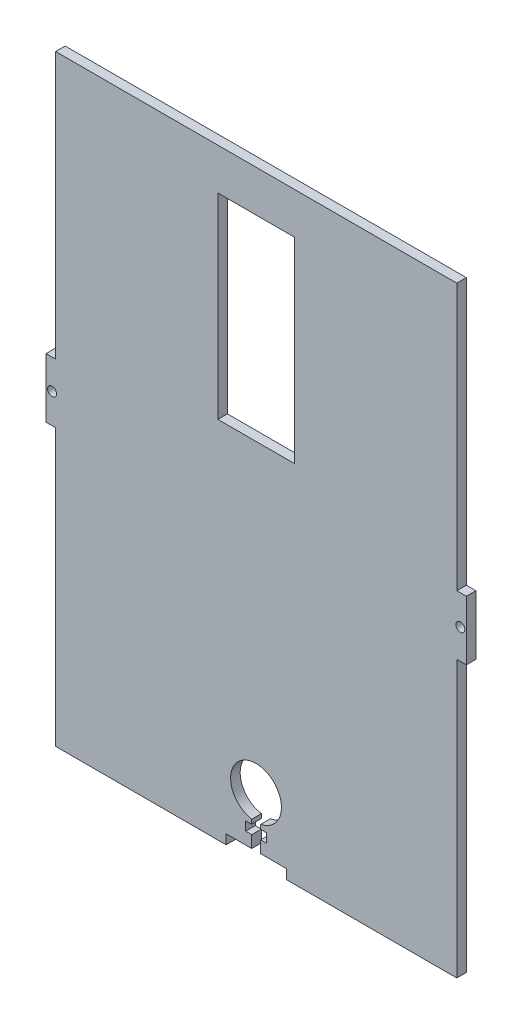
ISO-10303-21;
HEADER;
FILE_DESCRIPTION(('STEP AP214'),'2;1');
FILE_NAME('part.step','',(''),(''),'','','');
FILE_SCHEMA(('AUTOMOTIVE_DESIGN { 1 0 10303 214 1 1 1 1 }'));
ENDSEC;
DATA;
#1=APPLICATION_CONTEXT('core data for automotive mechanical design processes');
#2=APPLICATION_PROTOCOL_DEFINITION('international standard','automotive_design',2000,#1);
#3=PRODUCT_CONTEXT('',#1,'mechanical');
#4=PRODUCT('Part','Part','',(#3));
#5=PRODUCT_RELATED_PRODUCT_CATEGORY('part','',(#4));
#6=PRODUCT_DEFINITION_FORMATION('','',#4);
#7=PRODUCT_DEFINITION_CONTEXT('part definition',#1,'design');
#8=PRODUCT_DEFINITION('design','',#6,#7);
#9=PRODUCT_DEFINITION_SHAPE('','',#8);
#10=(LENGTH_UNIT() NAMED_UNIT(*) SI_UNIT(.MILLI.,.METRE.));
#11=(NAMED_UNIT(*) PLANE_ANGLE_UNIT() SI_UNIT($,.RADIAN.));
#12=(NAMED_UNIT(*) SI_UNIT($,.STERADIAN.) SOLID_ANGLE_UNIT());
#13=UNCERTAINTY_MEASURE_WITH_UNIT(LENGTH_MEASURE(1.E-05),#10,'distance_accuracy_value','');
#14=(GEOMETRIC_REPRESENTATION_CONTEXT(3) GLOBAL_UNCERTAINTY_ASSIGNED_CONTEXT((#13)) GLOBAL_UNIT_ASSIGNED_CONTEXT((#10,
#11,#12)) REPRESENTATION_CONTEXT('',''));
#15=CARTESIAN_POINT('',(0.,0.,0.));
#16=DIRECTION('',(0.,0.,1.));
#17=DIRECTION('',(1.,0.,0.));
#18=AXIS2_PLACEMENT_3D('',#15,#16,#17);
#19=CARTESIAN_POINT('',(-69.85,-101.6,3.18));
#20=DIRECTION('',(0.,1.,0.));
#21=DIRECTION('',(0.,0.,1.));
#22=AXIS2_PLACEMENT_3D('',#19,#20,#21);
#23=PLANE('',#22);
#24=DIRECTION('',(1.,0.,0.));
#25=VECTOR('',#24,1.);
#26=CARTESIAN_POINT('',(-69.85,-101.6,0.));
#27=LINE('',#26,#25);
#28=CARTESIAN_POINT('',(-66.67,-101.6,0.));
#29=VERTEX_POINT('',#28);
#30=CARTESIAN_POINT('',(-10.,-101.6,0.));
#31=VERTEX_POINT('',#30);
#32=EDGE_CURVE('E286',#29,#31,#27,.T.);
#33=ORIENTED_EDGE('',*,*,#32,.T.);
#34=DIRECTION('',(0.,0.,1.));
#35=VECTOR('',#34,1.);
#36=CARTESIAN_POINT('',(-10.,-101.6,0.));
#37=LINE('',#36,#35);
#38=CARTESIAN_POINT('',(-10.,-101.6,3.18));
#39=VERTEX_POINT('',#38);
#40=EDGE_CURVE('E296',#31,#39,#37,.T.);
#41=ORIENTED_EDGE('',*,*,#40,.T.);
#42=DIRECTION('',(1.,0.,0.));
#43=VECTOR('',#42,1.);
#44=CARTESIAN_POINT('',(-69.85,-101.6,3.18));
#45=LINE('',#44,#43);
#46=CARTESIAN_POINT('',(-66.67,-101.6,3.18));
#47=VERTEX_POINT('',#46);
#48=EDGE_CURVE('E47',#47,#39,#45,.T.);
#49=ORIENTED_EDGE('',*,*,#48,.F.);
#50=DIRECTION('',(0.,0.,1.));
#51=VECTOR('',#50,1.);
#52=CARTESIAN_POINT('',(-66.67,-101.6,0.));
#53=LINE('',#52,#51);
#54=EDGE_CURVE('E311',#29,#47,#53,.T.);
#55=ORIENTED_EDGE('',*,*,#54,.F.);
#56=EDGE_LOOP('',(#33,#41,#49,#55));
#57=FACE_BOUND('',#56,.T.);
#58=ADVANCED_FACE('F39',(#57),#23,.F.);
#59=CARTESIAN_POINT('',(69.85,101.6,3.18));
#60=DIRECTION('',(-1.,0.,0.));
#61=DIRECTION('',(0.,-1.,0.));
#62=AXIS2_PLACEMENT_3D('',#59,#60,#61);
#63=PLANE('',#62);
#64=DIRECTION('',(0.,1.,0.));
#65=VECTOR('',#64,1.);
#66=CARTESIAN_POINT('',(69.85,101.6,0.));
#67=LINE('',#66,#65);
#68=CARTESIAN_POINT('',(69.85,-9.875,0.));
#69=VERTEX_POINT('',#68);
#70=CARTESIAN_POINT('',(69.85,9.875,0.));
#71=VERTEX_POINT('',#70);
#72=EDGE_CURVE('E292',#69,#71,#67,.T.);
#73=ORIENTED_EDGE('',*,*,#72,.T.);
#74=DIRECTION('',(0.,0.,1.));
#75=VECTOR('',#74,1.);
#76=CARTESIAN_POINT('',(69.85,9.875,0.));
#77=LINE('',#76,#75);
#78=CARTESIAN_POINT('',(69.85,9.875,3.18));
#79=VERTEX_POINT('',#78);
#80=EDGE_CURVE('E278',#71,#79,#77,.T.);
#81=ORIENTED_EDGE('',*,*,#80,.T.);
#82=DIRECTION('',(0.,1.,0.));
#83=VECTOR('',#82,1.);
#84=CARTESIAN_POINT('',(69.85,101.6,3.18));
#85=LINE('',#84,#83);
#86=CARTESIAN_POINT('',(69.85,-9.875,3.18));
#87=VERTEX_POINT('',#86);
#88=EDGE_CURVE('E282',#87,#79,#85,.T.);
#89=ORIENTED_EDGE('',*,*,#88,.F.);
#90=DIRECTION('',(0.,0.,1.));
#91=VECTOR('',#90,1.);
#92=CARTESIAN_POINT('',(69.85,-9.875,0.));
#93=LINE('',#92,#91);
#94=EDGE_CURVE('E418',#69,#87,#93,.T.);
#95=ORIENTED_EDGE('',*,*,#94,.F.);
#96=EDGE_LOOP('',(#73,#81,#89,#95));
#97=FACE_BOUND('',#96,.T.);
#98=ADVANCED_FACE('F41',(#97),#63,.F.);
#99=CARTESIAN_POINT('',(-69.85,101.6,3.18));
#100=DIRECTION('',(1.,0.,0.));
#101=DIRECTION('',(0.,1.,0.));
#102=AXIS2_PLACEMENT_3D('',#99,#100,#101);
#103=PLANE('',#102);
#104=DIRECTION('',(0.,-1.,0.));
#105=VECTOR('',#104,1.);
#106=CARTESIAN_POINT('',(-69.85,101.6,3.18));
#107=LINE('',#106,#105);
#108=CARTESIAN_POINT('',(-69.85,9.875,3.18));
#109=VERTEX_POINT('',#108);
#110=CARTESIAN_POINT('',(-69.85,-9.875,3.18));
#111=VERTEX_POINT('',#110);
#112=EDGE_CURVE('E285',#109,#111,#107,.T.);
#113=ORIENTED_EDGE('',*,*,#112,.F.);
#114=DIRECTION('',(0.,0.,1.));
#115=VECTOR('',#114,1.);
#116=CARTESIAN_POINT('',(-69.85,9.875,0.));
#117=LINE('',#116,#115);
#118=CARTESIAN_POINT('',(-69.85,9.875,0.));
#119=VERTEX_POINT('',#118);
#120=EDGE_CURVE('E402',#119,#109,#117,.T.);
#121=ORIENTED_EDGE('',*,*,#120,.F.);
#122=DIRECTION('',(0.,-1.,0.));
#123=VECTOR('',#122,1.);
#124=CARTESIAN_POINT('',(-69.85,101.6,0.));
#125=LINE('',#124,#123);
#126=CARTESIAN_POINT('',(-69.85,-9.875,0.));
#127=VERTEX_POINT('',#126);
#128=EDGE_CURVE('E295',#119,#127,#125,.T.);
#129=ORIENTED_EDGE('',*,*,#128,.T.);
#130=DIRECTION('',(0.,0.,1.));
#131=VECTOR('',#130,1.);
#132=CARTESIAN_POINT('',(-69.85,-9.875,0.));
#133=LINE('',#132,#131);
#134=EDGE_CURVE('E406',#127,#111,#133,.T.);
#135=ORIENTED_EDGE('',*,*,#134,.T.);
#136=EDGE_LOOP('',(#113,#121,#129,#135));
#137=FACE_BOUND('',#136,.T.);
#138=ADVANCED_FACE('F557',(#137),#103,.F.);
#139=CARTESIAN_POINT('',(10.,-101.6,0.));
#140=VERTEX_POINT('',#139);
#141=CARTESIAN_POINT('',(66.67,-101.6,0.));
#142=VERTEX_POINT('',#141);
#143=EDGE_CURVE('E298',#140,#142,#27,.T.);
#144=ORIENTED_EDGE('',*,*,#143,.T.);
#145=DIRECTION('',(0.,0.,1.));
#146=VECTOR('',#145,1.);
#147=CARTESIAN_POINT('',(66.67,-101.6,0.));
#148=LINE('',#147,#146);
#149=CARTESIAN_POINT('',(66.67,-101.6,3.18));
#150=VERTEX_POINT('',#149);
#151=EDGE_CURVE('E424',#142,#150,#148,.T.);
#152=ORIENTED_EDGE('',*,*,#151,.T.);
#153=CARTESIAN_POINT('',(10.,-101.6,3.18));
#154=VERTEX_POINT('',#153);
#155=EDGE_CURVE('E289',#154,#150,#45,.T.);
#156=ORIENTED_EDGE('',*,*,#155,.F.);
#157=DIRECTION('',(0.,0.,1.));
#158=VECTOR('',#157,1.);
#159=CARTESIAN_POINT('',(10.,-101.6,0.));
#160=LINE('',#159,#158);
#161=EDGE_CURVE('E323',#140,#154,#160,.T.);
#162=ORIENTED_EDGE('',*,*,#161,.F.);
#163=EDGE_LOOP('',(#144,#152,#156,#162));
#164=FACE_BOUND('',#163,.T.);
#165=ADVANCED_FACE('F440',(#164),#23,.F.);
#166=CARTESIAN_POINT('',(0.,0.,3.18));
#167=DIRECTION('',(0.,0.,1.));
#168=DIRECTION('',(1.,0.,0.));
#169=AXIS2_PLACEMENT_3D('',#166,#167,#168);
#170=PLANE('',#169);
#171=DIRECTION('',(-1.,0.,0.));
#172=VECTOR('',#171,1.);
#173=CARTESIAN_POINT('',(66.67,98.42,3.18));
#174=LINE('',#173,#172);
#175=CARTESIAN_POINT('',(66.67,98.42,3.18));
#176=VERTEX_POINT('',#175);
#177=CARTESIAN_POINT('',(-66.67,98.42,3.18));
#178=VERTEX_POINT('',#177);
#179=EDGE_CURVE('E59',#176,#178,#174,.T.);
#180=ORIENTED_EDGE('',*,*,#179,.T.);
#181=DIRECTION('',(0.,1.,0.));
#182=VECTOR('',#181,1.);
#183=CARTESIAN_POINT('',(-66.67,101.6,3.18));
#184=LINE('',#183,#182);
#185=CARTESIAN_POINT('',(-66.67,9.875,3.18));
#186=VERTEX_POINT('',#185);
#187=EDGE_CURVE('E400',#186,#178,#184,.T.);
#188=ORIENTED_EDGE('',*,*,#187,.F.);
#189=DIRECTION('',(1.,0.,0.));
#190=VECTOR('',#189,1.);
#191=CARTESIAN_POINT('',(-69.85,9.875,3.18));
#192=LINE('',#191,#190);
#193=EDGE_CURVE('E403',#109,#186,#192,.T.);
#194=ORIENTED_EDGE('',*,*,#193,.F.);
#195=ORIENTED_EDGE('',*,*,#112,.T.);
#196=DIRECTION('',(-1.,0.,0.));
#197=VECTOR('',#196,1.);
#198=CARTESIAN_POINT('',(-69.85,-9.875,3.18));
#199=LINE('',#198,#197);
#200=CARTESIAN_POINT('',(-66.67,-9.87499999999999,3.18));
#201=VERTEX_POINT('',#200);
#202=EDGE_CURVE('E497',#201,#111,#199,.T.);
#203=ORIENTED_EDGE('',*,*,#202,.F.);
#204=DIRECTION('',(0.,1.,0.));
#205=VECTOR('',#204,1.);
#206=CARTESIAN_POINT('',(-66.67,-101.6,3.18));
#207=LINE('',#206,#205);
#208=EDGE_CURVE('E449',#47,#201,#207,.T.);
#209=ORIENTED_EDGE('',*,*,#208,.F.);
#210=ORIENTED_EDGE('',*,*,#48,.T.);
#211=DIRECTION('',(0.,-1.,0.));
#212=VECTOR('',#211,1.);
#213=CARTESIAN_POINT('',(-10.,-101.6,3.18));
#214=LINE('',#213,#212);
#215=CARTESIAN_POINT('',(-10.,-98.42,3.18));
#216=VERTEX_POINT('',#215);
#217=EDGE_CURVE('E370',#216,#39,#214,.T.);
#218=ORIENTED_EDGE('',*,*,#217,.F.);
#219=DIRECTION('',(-1.,0.,0.));
#220=VECTOR('',#219,1.);
#221=CARTESIAN_POINT('',(-10.,-98.42,3.18));
#222=LINE('',#221,#220);
#223=CARTESIAN_POINT('',(-1.5,-98.42,3.18));
#224=VERTEX_POINT('',#223);
#225=EDGE_CURVE('E367',#224,#216,#222,.T.);
#226=ORIENTED_EDGE('',*,*,#225,.F.);
#227=DIRECTION('',(0.,-1.,0.));
#228=VECTOR('',#227,1.);
#229=CARTESIAN_POINT('',(-1.5,-94.42,3.18));
#230=LINE('',#229,#228);
#231=CARTESIAN_POINT('',(-1.5,-94.42,3.18));
#232=VERTEX_POINT('',#231);
#233=EDGE_CURVE('E364',#232,#224,#230,.T.);
#234=ORIENTED_EDGE('',*,*,#233,.F.);
#235=DIRECTION('',(1.,0.,0.));
#236=VECTOR('',#235,1.);
#237=CARTESIAN_POINT('',(-1.5,-94.42,3.18));
#238=LINE('',#237,#236);
#239=CARTESIAN_POINT('',(-3.5,-94.42,3.18));
#240=VERTEX_POINT('',#239);
#241=EDGE_CURVE('E361',#240,#232,#238,.T.);
#242=ORIENTED_EDGE('',*,*,#241,.F.);
#243=DIRECTION('',(0.,-1.,0.));
#244=VECTOR('',#243,1.);
#245=CARTESIAN_POINT('',(-3.5,-94.42,3.18));
#246=LINE('',#245,#244);
#247=CARTESIAN_POINT('',(-3.5,-91.42,3.18));
#248=VERTEX_POINT('',#247);
#249=EDGE_CURVE('E358',#248,#240,#246,.T.);
#250=ORIENTED_EDGE('',*,*,#249,.F.);
#251=DIRECTION('',(-1.,0.,0.));
#252=VECTOR('',#251,1.);
#253=CARTESIAN_POINT('',(-1.5,-91.42,3.18));
#254=LINE('',#253,#252);
#255=CARTESIAN_POINT('',(-1.5,-91.42,3.18));
#256=VERTEX_POINT('',#255);
#257=EDGE_CURVE('E355',#256,#248,#254,.T.);
#258=ORIENTED_EDGE('',*,*,#257,.F.);
#259=DIRECTION('',(0.,-1.,0.));
#260=VECTOR('',#259,1.);
#261=CARTESIAN_POINT('',(-1.5,-88.42,3.18));
#262=LINE('',#261,#260);
#263=CARTESIAN_POINT('',(-1.5,-89.9684328093629,3.18));
#264=VERTEX_POINT('',#263);
#265=EDGE_CURVE('E353',#264,#256,#262,.T.);
#266=ORIENTED_EDGE('',*,*,#265,.F.);
#267=CARTESIAN_POINT('',(-0.0688131015600852,-81.6486384620616,3.18));
#268=DIRECTION('',(0.,0.,1.));
#269=DIRECTION('',(1.,0.,0.));
#270=AXIS2_PLACEMENT_3D('',#267,#268,#269);
#271=CIRCLE('',#270,8.44199466474909);
#272=CARTESIAN_POINT('',(1.5,-89.9435826675416,3.18));
#273=VERTEX_POINT('',#272);
#274=EDGE_CURVE('E513',#273,#264,#271,.T.);
#275=ORIENTED_EDGE('',*,*,#274,.F.);
#276=DIRECTION('',(0.,1.,0.));
#277=VECTOR('',#276,1.);
#278=CARTESIAN_POINT('',(1.5,-88.42,3.18));
#279=LINE('',#278,#277);
#280=CARTESIAN_POINT('',(1.5,-91.42,3.18));
#281=VERTEX_POINT('',#280);
#282=EDGE_CURVE('E350',#281,#273,#279,.T.);
#283=ORIENTED_EDGE('',*,*,#282,.F.);
#284=DIRECTION('',(-1.,0.,0.));
#285=VECTOR('',#284,1.);
#286=CARTESIAN_POINT('',(3.5,-91.42,3.18));
#287=LINE('',#286,#285);
#288=CARTESIAN_POINT('',(3.5,-91.42,3.18));
#289=VERTEX_POINT('',#288);
#290=EDGE_CURVE('E347',#289,#281,#287,.T.);
#291=ORIENTED_EDGE('',*,*,#290,.F.);
#292=DIRECTION('',(0.,1.,0.));
#293=VECTOR('',#292,1.);
#294=CARTESIAN_POINT('',(3.5,-94.42,3.18));
#295=LINE('',#294,#293);
#296=CARTESIAN_POINT('',(3.5,-94.42,3.18));
#297=VERTEX_POINT('',#296);
#298=EDGE_CURVE('E344',#297,#289,#295,.T.);
#299=ORIENTED_EDGE('',*,*,#298,.F.);
#300=DIRECTION('',(1.,0.,0.));
#301=VECTOR('',#300,1.);
#302=CARTESIAN_POINT('',(3.5,-94.42,3.18));
#303=LINE('',#302,#301);
#304=CARTESIAN_POINT('',(1.5,-94.42,3.18));
#305=VERTEX_POINT('',#304);
#306=EDGE_CURVE('E341',#305,#297,#303,.T.);
#307=ORIENTED_EDGE('',*,*,#306,.F.);
#308=DIRECTION('',(0.,1.,0.));
#309=VECTOR('',#308,1.);
#310=CARTESIAN_POINT('',(1.5,-94.42,3.18));
#311=LINE('',#310,#309);
#312=CARTESIAN_POINT('',(1.5,-98.42,3.18));
#313=VERTEX_POINT('',#312);
#314=EDGE_CURVE('E338',#313,#305,#311,.T.);
#315=ORIENTED_EDGE('',*,*,#314,.F.);
#316=DIRECTION('',(-1.,0.,0.));
#317=VECTOR('',#316,1.);
#318=CARTESIAN_POINT('',(1.5,-98.42,3.18));
#319=LINE('',#318,#317);
#320=CARTESIAN_POINT('',(10.,-98.42,3.18));
#321=VERTEX_POINT('',#320);
#322=EDGE_CURVE('E334',#321,#313,#319,.T.);
#323=ORIENTED_EDGE('',*,*,#322,.F.);
#324=DIRECTION('',(0.,1.,0.));
#325=VECTOR('',#324,1.);
#326=CARTESIAN_POINT('',(10.,-101.6,3.18));
#327=LINE('',#326,#325);
#328=EDGE_CURVE('E331',#154,#321,#327,.T.);
#329=ORIENTED_EDGE('',*,*,#328,.F.);
#330=ORIENTED_EDGE('',*,*,#155,.T.);
#331=DIRECTION('',(0.,-1.,0.));
#332=VECTOR('',#331,1.);
#333=CARTESIAN_POINT('',(66.67,-101.6,3.18));
#334=LINE('',#333,#332);
#335=CARTESIAN_POINT('',(66.67,-9.87499999999999,3.18));
#336=VERTEX_POINT('',#335);
#337=EDGE_CURVE('E415',#336,#150,#334,.T.);
#338=ORIENTED_EDGE('',*,*,#337,.F.);
#339=DIRECTION('',(-1.,0.,0.));
#340=VECTOR('',#339,1.);
#341=CARTESIAN_POINT('',(69.85,-9.875,3.18));
#342=LINE('',#341,#340);
#343=EDGE_CURVE('E419',#87,#336,#342,.T.);
#344=ORIENTED_EDGE('',*,*,#343,.F.);
#345=ORIENTED_EDGE('',*,*,#88,.T.);
#346=DIRECTION('',(1.,0.,0.));
#347=VECTOR('',#346,1.);
#348=CARTESIAN_POINT('',(69.85,9.875,3.18));
#349=LINE('',#348,#347);
#350=CARTESIAN_POINT('',(66.67,9.875,3.18));
#351=VERTEX_POINT('',#350);
#352=EDGE_CURVE('E267',#351,#79,#349,.T.);
#353=ORIENTED_EDGE('',*,*,#352,.F.);
#354=DIRECTION('',(0.,-1.,0.));
#355=VECTOR('',#354,1.);
#356=CARTESIAN_POINT('',(66.67,101.6,3.18));
#357=LINE('',#356,#355);
#358=EDGE_CURVE('E270',#176,#351,#357,.T.);
#359=ORIENTED_EDGE('',*,*,#358,.F.);
#360=EDGE_LOOP('',(#180,#188,#194,#195,#203,#209,#210,#218,#226,#234,#242,#250,#258,#266,#275,
#283,#291,#299,#307,#315,#323,#329,#330,#338,#344,#345,#353,#359));
#361=FACE_BOUND('',#360,.T.);
#362=DIRECTION('',(0.,1.,0.));
#363=VECTOR('',#362,1.);
#364=CARTESIAN_POINT('',(12.7653119627098,0.,3.18));
#365=LINE('',#364,#363);
#366=CARTESIAN_POINT('',(12.7653119627098,19.4861878039916,3.18));
#367=VERTEX_POINT('',#366);
#368=CARTESIAN_POINT('',(12.7653119627098,84.6626318750197,3.18));
#369=VERTEX_POINT('',#368);
#370=EDGE_CURVE('E517',#367,#369,#365,.T.);
#371=ORIENTED_EDGE('',*,*,#370,.F.);
#372=DIRECTION('',(1.,0.,0.));
#373=VECTOR('',#372,1.);
#374=CARTESIAN_POINT('',(0.,19.4861878039916,3.18));
#375=LINE('',#374,#373);
#376=CARTESIAN_POINT('',(-12.7653119627098,19.4861878039916,3.18));
#377=VERTEX_POINT('',#376);
#378=EDGE_CURVE('E524',#377,#367,#375,.T.);
#379=ORIENTED_EDGE('',*,*,#378,.F.);
#380=DIRECTION('',(0.,-1.,0.));
#381=VECTOR('',#380,1.);
#382=CARTESIAN_POINT('',(-12.7653119627098,0.,3.18));
#383=LINE('',#382,#381);
#384=CARTESIAN_POINT('',(-12.7653119627098,84.6626318750197,3.18));
#385=VERTEX_POINT('',#384);
#386=EDGE_CURVE('E521',#385,#377,#383,.T.);
#387=ORIENTED_EDGE('',*,*,#386,.F.);
#388=DIRECTION('',(-1.,0.,0.));
#389=VECTOR('',#388,1.);
#390=CARTESIAN_POINT('',(0.,84.6626318750197,3.18));
#391=LINE('',#390,#389);
#392=EDGE_CURVE('E519',#369,#385,#391,.T.);
#393=ORIENTED_EDGE('',*,*,#392,.F.);
#394=EDGE_LOOP('',(#371,#379,#387,#393));
#395=FACE_BOUND('',#394,.T.);
#396=CARTESIAN_POINT('',(67.85,0.,3.18));
#397=DIRECTION('',(0.,0.,1.));
#398=DIRECTION('',(-1.,0.,0.));
#399=AXIS2_PLACEMENT_3D('',#396,#397,#398);
#400=CIRCLE('',#399,1.5);
#401=CARTESIAN_POINT('',(66.35,0.,3.18));
#402=VERTEX_POINT('',#401);
#403=EDGE_CURVE('E273',#402,#402,#400,.T.);
#404=ORIENTED_EDGE('',*,*,#403,.F.);
#405=EDGE_LOOP('',(#404));
#406=FACE_BOUND('',#405,.T.);
#407=CARTESIAN_POINT('',(-67.85,0.,3.18));
#408=DIRECTION('',(0.,0.,1.));
#409=DIRECTION('',(1.,0.,0.));
#410=AXIS2_PLACEMENT_3D('',#407,#408,#409);
#411=CIRCLE('',#410,1.5);
#412=CARTESIAN_POINT('',(-66.35,0.,3.18));
#413=VERTEX_POINT('',#412);
#414=EDGE_CURVE('E426',#413,#413,#411,.T.);
#415=ORIENTED_EDGE('',*,*,#414,.F.);
#416=EDGE_LOOP('',(#415));
#417=FACE_BOUND('',#416,.T.);
#418=ADVANCED_FACE('F437',(#361,#395,#406,#417),#170,.T.);
#419=CARTESIAN_POINT('',(0.,0.,0.));
#420=DIRECTION('',(0.,0.,1.));
#421=DIRECTION('',(1.,0.,0.));
#422=AXIS2_PLACEMENT_3D('',#419,#420,#421);
#423=PLANE('',#422);
#424=DIRECTION('',(0.,1.,0.));
#425=VECTOR('',#424,1.);
#426=CARTESIAN_POINT('',(-66.67,101.6,0.));
#427=LINE('',#426,#425);
#428=CARTESIAN_POINT('',(-66.67,9.875,0.));
#429=VERTEX_POINT('',#428);
#430=CARTESIAN_POINT('',(-66.67,98.42,0.));
#431=VERTEX_POINT('',#430);
#432=EDGE_CURVE('E259',#429,#431,#427,.T.);
#433=ORIENTED_EDGE('',*,*,#432,.T.);
#434=DIRECTION('',(-1.,0.,0.));
#435=VECTOR('',#434,1.);
#436=CARTESIAN_POINT('',(66.67,98.42,0.));
#437=LINE('',#436,#435);
#438=CARTESIAN_POINT('',(66.67,98.42,0.));
#439=VERTEX_POINT('',#438);
#440=EDGE_CURVE('E54',#439,#431,#437,.T.);
#441=ORIENTED_EDGE('',*,*,#440,.F.);
#442=DIRECTION('',(0.,-1.,0.));
#443=VECTOR('',#442,1.);
#444=CARTESIAN_POINT('',(66.67,101.6,0.));
#445=LINE('',#444,#443);
#446=CARTESIAN_POINT('',(66.67,9.875,0.));
#447=VERTEX_POINT('',#446);
#448=EDGE_CURVE('E256',#439,#447,#445,.T.);
#449=ORIENTED_EDGE('',*,*,#448,.T.);
#450=DIRECTION('',(1.,0.,0.));
#451=VECTOR('',#450,1.);
#452=CARTESIAN_POINT('',(69.85,9.875,0.));
#453=LINE('',#452,#451);
#454=EDGE_CURVE('E266',#447,#71,#453,.T.);
#455=ORIENTED_EDGE('',*,*,#454,.T.);
#456=ORIENTED_EDGE('',*,*,#72,.F.);
#457=DIRECTION('',(-1.,0.,0.));
#458=VECTOR('',#457,1.);
#459=CARTESIAN_POINT('',(69.85,-9.875,0.));
#460=LINE('',#459,#458);
#461=CARTESIAN_POINT('',(66.67,-9.87499999999999,0.));
#462=VERTEX_POINT('',#461);
#463=EDGE_CURVE('E411',#69,#462,#460,.T.);
#464=ORIENTED_EDGE('',*,*,#463,.T.);
#465=DIRECTION('',(0.,-1.,0.));
#466=VECTOR('',#465,1.);
#467=CARTESIAN_POINT('',(66.67,-101.6,0.));
#468=LINE('',#467,#466);
#469=EDGE_CURVE('E414',#462,#142,#468,.T.);
#470=ORIENTED_EDGE('',*,*,#469,.T.);
#471=ORIENTED_EDGE('',*,*,#143,.F.);
#472=DIRECTION('',(0.,1.,0.));
#473=VECTOR('',#472,1.);
#474=CARTESIAN_POINT('',(10.,-101.6,0.));
#475=LINE('',#474,#473);
#476=CARTESIAN_POINT('',(10.,-98.42,0.));
#477=VERTEX_POINT('',#476);
#478=EDGE_CURVE('E372',#140,#477,#475,.T.);
#479=ORIENTED_EDGE('',*,*,#478,.T.);
#480=DIRECTION('',(-1.,0.,0.));
#481=VECTOR('',#480,1.);
#482=CARTESIAN_POINT('',(1.5,-98.42,0.));
#483=LINE('',#482,#481);
#484=CARTESIAN_POINT('',(1.5,-98.42,0.));
#485=VERTEX_POINT('',#484);
#486=EDGE_CURVE('E455',#477,#485,#483,.T.);
#487=ORIENTED_EDGE('',*,*,#486,.T.);
#488=DIRECTION('',(0.,1.,0.));
#489=VECTOR('',#488,1.);
#490=CARTESIAN_POINT('',(1.5,-94.42,0.));
#491=LINE('',#490,#489);
#492=CARTESIAN_POINT('',(1.5,-94.42,0.));
#493=VERTEX_POINT('',#492);
#494=EDGE_CURVE('E458',#485,#493,#491,.T.);
#495=ORIENTED_EDGE('',*,*,#494,.T.);
#496=DIRECTION('',(1.,0.,0.));
#497=VECTOR('',#496,1.);
#498=CARTESIAN_POINT('',(3.5,-94.42,0.));
#499=LINE('',#498,#497);
#500=CARTESIAN_POINT('',(3.5,-94.42,0.));
#501=VERTEX_POINT('',#500);
#502=EDGE_CURVE('E461',#493,#501,#499,.T.);
#503=ORIENTED_EDGE('',*,*,#502,.T.);
#504=DIRECTION('',(0.,1.,0.));
#505=VECTOR('',#504,1.);
#506=CARTESIAN_POINT('',(3.5,-94.42,0.));
#507=LINE('',#506,#505);
#508=CARTESIAN_POINT('',(3.5,-91.42,0.));
#509=VERTEX_POINT('',#508);
#510=EDGE_CURVE('E464',#501,#509,#507,.T.);
#511=ORIENTED_EDGE('',*,*,#510,.T.);
#512=DIRECTION('',(-1.,0.,0.));
#513=VECTOR('',#512,1.);
#514=CARTESIAN_POINT('',(3.5,-91.42,0.));
#515=LINE('',#514,#513);
#516=CARTESIAN_POINT('',(1.5,-91.42,0.));
#517=VERTEX_POINT('',#516);
#518=EDGE_CURVE('E467',#509,#517,#515,.T.);
#519=ORIENTED_EDGE('',*,*,#518,.T.);
#520=DIRECTION('',(0.,1.,0.));
#521=VECTOR('',#520,1.);
#522=CARTESIAN_POINT('',(1.5,-88.42,0.));
#523=LINE('',#522,#521);
#524=CARTESIAN_POINT('',(1.5,-89.9435826675416,0.));
#525=VERTEX_POINT('',#524);
#526=EDGE_CURVE('E470',#517,#525,#523,.T.);
#527=ORIENTED_EDGE('',*,*,#526,.T.);
#528=CARTESIAN_POINT('',(-0.0688131015600852,-81.6486384620616,0.));
#529=DIRECTION('',(0.,0.,-1.));
#530=DIRECTION('',(-1.,0.,0.));
#531=AXIS2_PLACEMENT_3D('',#528,#529,#530);
#532=CIRCLE('',#531,8.44199466474909);
#533=CARTESIAN_POINT('',(-1.5,-89.9684328093629,0.));
#534=VERTEX_POINT('',#533);
#535=EDGE_CURVE('E515',#534,#525,#532,.T.);
#536=ORIENTED_EDGE('',*,*,#535,.F.);
#537=DIRECTION('',(0.,-1.,0.));
#538=VECTOR('',#537,1.);
#539=CARTESIAN_POINT('',(-1.5,-88.42,0.));
#540=LINE('',#539,#538);
#541=CARTESIAN_POINT('',(-1.5,-91.42,0.));
#542=VERTEX_POINT('',#541);
#543=EDGE_CURVE('E473',#534,#542,#540,.T.);
#544=ORIENTED_EDGE('',*,*,#543,.T.);
#545=DIRECTION('',(-1.,0.,0.));
#546=VECTOR('',#545,1.);
#547=CARTESIAN_POINT('',(-1.5,-91.42,0.));
#548=LINE('',#547,#546);
#549=CARTESIAN_POINT('',(-3.5,-91.42,0.));
#550=VERTEX_POINT('',#549);
#551=EDGE_CURVE('E475',#542,#550,#548,.T.);
#552=ORIENTED_EDGE('',*,*,#551,.T.);
#553=DIRECTION('',(0.,-1.,0.));
#554=VECTOR('',#553,1.);
#555=CARTESIAN_POINT('',(-3.5,-94.42,0.));
#556=LINE('',#555,#554);
#557=CARTESIAN_POINT('',(-3.5,-94.42,0.));
#558=VERTEX_POINT('',#557);
#559=EDGE_CURVE('E478',#550,#558,#556,.T.);
#560=ORIENTED_EDGE('',*,*,#559,.T.);
#561=DIRECTION('',(1.,0.,0.));
#562=VECTOR('',#561,1.);
#563=CARTESIAN_POINT('',(-1.5,-94.42,0.));
#564=LINE('',#563,#562);
#565=CARTESIAN_POINT('',(-1.5,-94.42,0.));
#566=VERTEX_POINT('',#565);
#567=EDGE_CURVE('E481',#558,#566,#564,.T.);
#568=ORIENTED_EDGE('',*,*,#567,.T.);
#569=DIRECTION('',(0.,-1.,0.));
#570=VECTOR('',#569,1.);
#571=CARTESIAN_POINT('',(-1.5,-94.42,0.));
#572=LINE('',#571,#570);
#573=CARTESIAN_POINT('',(-1.5,-98.42,0.));
#574=VERTEX_POINT('',#573);
#575=EDGE_CURVE('E327',#566,#574,#572,.T.);
#576=ORIENTED_EDGE('',*,*,#575,.T.);
#577=DIRECTION('',(-1.,0.,0.));
#578=VECTOR('',#577,1.);
#579=CARTESIAN_POINT('',(-10.,-98.42,0.));
#580=LINE('',#579,#578);
#581=CARTESIAN_POINT('',(-10.,-98.42,0.));
#582=VERTEX_POINT('',#581);
#583=EDGE_CURVE('E321',#574,#582,#580,.T.);
#584=ORIENTED_EDGE('',*,*,#583,.T.);
#585=DIRECTION('',(0.,-1.,0.));
#586=VECTOR('',#585,1.);
#587=CARTESIAN_POINT('',(-10.,-101.6,0.));
#588=LINE('',#587,#586);
#589=EDGE_CURVE('E318',#582,#31,#588,.T.);
#590=ORIENTED_EDGE('',*,*,#589,.T.);
#591=ORIENTED_EDGE('',*,*,#32,.F.);
#592=DIRECTION('',(0.,1.,0.));
#593=VECTOR('',#592,1.);
#594=CARTESIAN_POINT('',(-66.67,-101.6,0.));
#595=LINE('',#594,#593);
#596=CARTESIAN_POINT('',(-66.67,-9.87499999999999,0.));
#597=VERTEX_POINT('',#596);
#598=EDGE_CURVE('E315',#29,#597,#595,.T.);
#599=ORIENTED_EDGE('',*,*,#598,.T.);
#600=DIRECTION('',(-1.,0.,0.));
#601=VECTOR('',#600,1.);
#602=CARTESIAN_POINT('',(-69.85,-9.875,0.));
#603=LINE('',#602,#601);
#604=EDGE_CURVE('E503',#597,#127,#603,.T.);
#605=ORIENTED_EDGE('',*,*,#604,.T.);
#606=ORIENTED_EDGE('',*,*,#128,.F.);
#607=DIRECTION('',(1.,0.,0.));
#608=VECTOR('',#607,1.);
#609=CARTESIAN_POINT('',(-69.85,9.875,0.));
#610=LINE('',#609,#608);
#611=EDGE_CURVE('E398',#119,#429,#610,.T.);
#612=ORIENTED_EDGE('',*,*,#611,.T.);
#613=EDGE_LOOP('',(#433,#441,#449,#455,#456,#464,#470,#471,#479,#487,#495,#503,#511,#519,#527,
#536,#544,#552,#560,#568,#576,#584,#590,#591,#599,#605,#606,#612));
#614=FACE_BOUND('',#613,.T.);
#615=DIRECTION('',(-1.,0.,0.));
#616=VECTOR('',#615,1.);
#617=CARTESIAN_POINT('',(-12.7653119627098,19.4861878039916,0.));
#618=LINE('',#617,#616);
#619=CARTESIAN_POINT('',(12.7653119627098,19.4861878039916,0.));
#620=VERTEX_POINT('',#619);
#621=CARTESIAN_POINT('',(-12.7653119627098,19.4861878039916,0.));
#622=VERTEX_POINT('',#621);
#623=EDGE_CURVE('E541',#620,#622,#618,.T.);
#624=ORIENTED_EDGE('',*,*,#623,.F.);
#625=DIRECTION('',(0.,-1.,0.));
#626=VECTOR('',#625,1.);
#627=CARTESIAN_POINT('',(12.7653119627098,84.6626318750197,0.));
#628=LINE('',#627,#626);
#629=CARTESIAN_POINT('',(12.7653119627098,84.6626318750197,0.));
#630=VERTEX_POINT('',#629);
#631=EDGE_CURVE('E249',#630,#620,#628,.T.);
#632=ORIENTED_EDGE('',*,*,#631,.F.);
#633=DIRECTION('',(1.,0.,0.));
#634=VECTOR('',#633,1.);
#635=CARTESIAN_POINT('',(-12.7653119627098,84.6626318750197,0.));
#636=LINE('',#635,#634);
#637=CARTESIAN_POINT('',(-12.7653119627098,84.6626318750197,0.));
#638=VERTEX_POINT('',#637);
#639=EDGE_CURVE('E531',#638,#630,#636,.T.);
#640=ORIENTED_EDGE('',*,*,#639,.F.);
#641=DIRECTION('',(0.,1.,0.));
#642=VECTOR('',#641,1.);
#643=CARTESIAN_POINT('',(-12.7653119627098,84.6626318750197,0.));
#644=LINE('',#643,#642);
#645=EDGE_CURVE('E538',#622,#638,#644,.T.);
#646=ORIENTED_EDGE('',*,*,#645,.F.);
#647=EDGE_LOOP('',(#624,#632,#640,#646));
#648=FACE_BOUND('',#647,.T.);
#649=CARTESIAN_POINT('',(67.85,0.,0.));
#650=DIRECTION('',(0.,0.,1.));
#651=DIRECTION('',(-1.,0.,0.));
#652=AXIS2_PLACEMENT_3D('',#649,#650,#651);
#653=CIRCLE('',#652,1.5);
#654=CARTESIAN_POINT('',(66.35,0.,0.));
#655=VERTEX_POINT('',#654);
#656=EDGE_CURVE('E422',#655,#655,#653,.T.);
#657=ORIENTED_EDGE('',*,*,#656,.T.);
#658=EDGE_LOOP('',(#657));
#659=FACE_BOUND('',#658,.T.);
#660=CARTESIAN_POINT('',(-67.85,0.,0.));
#661=DIRECTION('',(0.,0.,1.));
#662=DIRECTION('',(1.,0.,0.));
#663=AXIS2_PLACEMENT_3D('',#660,#661,#662);
#664=CIRCLE('',#663,1.5);
#665=CARTESIAN_POINT('',(-66.35,0.,0.));
#666=VERTEX_POINT('',#665);
#667=EDGE_CURVE('E446',#666,#666,#664,.T.);
#668=ORIENTED_EDGE('',*,*,#667,.T.);
#669=EDGE_LOOP('',(#668));
#670=FACE_BOUND('',#669,.T.);
#671=ADVANCED_FACE('F253',(#614,#648,#659,#670),#423,.F.);
#672=CARTESIAN_POINT('',(-67.85,0.,0.));
#673=DIRECTION('',(0.,0.,1.));
#674=DIRECTION('',(1.,0.,0.));
#675=AXIS2_PLACEMENT_3D('',#672,#673,#674);
#676=CYLINDRICAL_SURFACE('',#675,1.5);
#677=ORIENTED_EDGE('',*,*,#667,.F.);
#678=EDGE_LOOP('',(#677));
#679=FACE_BOUND('',#678,.T.);
#680=ORIENTED_EDGE('',*,*,#414,.T.);
#681=EDGE_LOOP('',(#680));
#682=FACE_BOUND('',#681,.T.);
#683=ADVANCED_FACE('F569',(#679,#682),#676,.F.);
#684=CARTESIAN_POINT('',(-69.85,-9.875,0.));
#685=DIRECTION('',(0.,1.,0.));
#686=DIRECTION('',(-1.,0.,0.));
#687=AXIS2_PLACEMENT_3D('',#684,#685,#686);
#688=PLANE('',#687);
#689=ORIENTED_EDGE('',*,*,#202,.T.);
#690=ORIENTED_EDGE('',*,*,#134,.F.);
#691=ORIENTED_EDGE('',*,*,#604,.F.);
#692=DIRECTION('',(0.,0.,1.));
#693=VECTOR('',#692,1.);
#694=CARTESIAN_POINT('',(-66.67,-9.87499999999999,0.));
#695=LINE('',#694,#693);
#696=EDGE_CURVE('E508',#597,#201,#695,.T.);
#697=ORIENTED_EDGE('',*,*,#696,.T.);
#698=EDGE_LOOP('',(#689,#690,#691,#697));
#699=FACE_BOUND('',#698,.T.);
#700=ADVANCED_FACE('F559',(#699),#688,.F.);
#701=CARTESIAN_POINT('',(-66.67,-101.6,0.));
#702=DIRECTION('',(1.,0.,0.));
#703=DIRECTION('',(0.,0.,-1.));
#704=AXIS2_PLACEMENT_3D('',#701,#702,#703);
#705=PLANE('',#704);
#706=ORIENTED_EDGE('',*,*,#208,.T.);
#707=ORIENTED_EDGE('',*,*,#696,.F.);
#708=ORIENTED_EDGE('',*,*,#598,.F.);
#709=ORIENTED_EDGE('',*,*,#54,.T.);
#710=EDGE_LOOP('',(#706,#707,#708,#709));
#711=FACE_BOUND('',#710,.T.);
#712=ADVANCED_FACE('F560',(#711),#705,.F.);
#713=CARTESIAN_POINT('',(-66.67,101.6,0.));
#714=DIRECTION('',(1.,0.,0.));
#715=DIRECTION('',(0.,1.,0.));
#716=AXIS2_PLACEMENT_3D('',#713,#714,#715);
#717=PLANE('',#716);
#718=ORIENTED_EDGE('',*,*,#187,.T.);
#719=DIRECTION('',(0.,0.,-1.));
#720=VECTOR('',#719,1.);
#721=CARTESIAN_POINT('',(-66.67,98.42,3.18));
#722=LINE('',#721,#720);
#723=EDGE_CURVE('E260',#178,#431,#722,.T.);
#724=ORIENTED_EDGE('',*,*,#723,.T.);
#725=ORIENTED_EDGE('',*,*,#432,.F.);
#726=DIRECTION('',(0.,0.,1.));
#727=VECTOR('',#726,1.);
#728=CARTESIAN_POINT('',(-66.67,9.875,0.));
#729=LINE('',#728,#727);
#730=EDGE_CURVE('E335',#429,#186,#729,.T.);
#731=ORIENTED_EDGE('',*,*,#730,.T.);
#732=EDGE_LOOP('',(#718,#724,#725,#731));
#733=FACE_BOUND('',#732,.T.);
#734=ADVANCED_FACE('F550',(#733),#717,.F.);
#735=CARTESIAN_POINT('',(-69.85,9.875,0.));
#736=DIRECTION('',(0.,-1.,0.));
#737=DIRECTION('',(1.,0.,0.));
#738=AXIS2_PLACEMENT_3D('',#735,#736,#737);
#739=PLANE('',#738);
#740=ORIENTED_EDGE('',*,*,#193,.T.);
#741=ORIENTED_EDGE('',*,*,#730,.F.);
#742=ORIENTED_EDGE('',*,*,#611,.F.);
#743=ORIENTED_EDGE('',*,*,#120,.T.);
#744=EDGE_LOOP('',(#740,#741,#742,#743));
#745=FACE_BOUND('',#744,.T.);
#746=ADVANCED_FACE('F553',(#745),#739,.F.);
#747=CARTESIAN_POINT('',(-10.,-101.6,0.));
#748=DIRECTION('',(-1.,0.,0.));
#749=DIRECTION('',(0.,-1.,0.));
#750=AXIS2_PLACEMENT_3D('',#747,#748,#749);
#751=PLANE('',#750);
#752=ORIENTED_EDGE('',*,*,#217,.T.);
#753=ORIENTED_EDGE('',*,*,#40,.F.);
#754=ORIENTED_EDGE('',*,*,#589,.F.);
#755=DIRECTION('',(0.,0.,1.));
#756=VECTOR('',#755,1.);
#757=CARTESIAN_POINT('',(-10.,-98.42,0.));
#758=LINE('',#757,#756);
#759=EDGE_CURVE('E374',#582,#216,#758,.T.);
#760=ORIENTED_EDGE('',*,*,#759,.T.);
#761=EDGE_LOOP('',(#752,#753,#754,#760));
#762=FACE_BOUND('',#761,.T.);
#763=ADVANCED_FACE('F492',(#762),#751,.F.);
#764=CARTESIAN_POINT('',(-10.,-98.42,0.));
#765=DIRECTION('',(0.,1.,0.));
#766=DIRECTION('',(0.,0.,1.));
#767=AXIS2_PLACEMENT_3D('',#764,#765,#766);
#768=PLANE('',#767);
#769=ORIENTED_EDGE('',*,*,#225,.T.);
#770=ORIENTED_EDGE('',*,*,#759,.F.);
#771=ORIENTED_EDGE('',*,*,#583,.F.);
#772=DIRECTION('',(0.,0.,1.));
#773=VECTOR('',#772,1.);
#774=CARTESIAN_POINT('',(-1.5,-98.42,0.));
#775=LINE('',#774,#773);
#776=EDGE_CURVE('E376',#574,#224,#775,.T.);
#777=ORIENTED_EDGE('',*,*,#776,.T.);
#778=EDGE_LOOP('',(#769,#770,#771,#777));
#779=FACE_BOUND('',#778,.T.);
#780=ADVANCED_FACE('F490',(#779),#768,.F.);
#781=CARTESIAN_POINT('',(-1.5,-94.42,0.));
#782=DIRECTION('',(-1.,0.,0.));
#783=DIRECTION('',(0.,0.,1.));
#784=AXIS2_PLACEMENT_3D('',#781,#782,#783);
#785=PLANE('',#784);
#786=ORIENTED_EDGE('',*,*,#233,.T.);
#787=ORIENTED_EDGE('',*,*,#776,.F.);
#788=ORIENTED_EDGE('',*,*,#575,.F.);
#789=DIRECTION('',(0.,0.,1.));
#790=VECTOR('',#789,1.);
#791=CARTESIAN_POINT('',(-1.5,-94.42,0.));
#792=LINE('',#791,#790);
#793=EDGE_CURVE('E378',#566,#232,#792,.T.);
#794=ORIENTED_EDGE('',*,*,#793,.T.);
#795=EDGE_LOOP('',(#786,#787,#788,#794));
#796=FACE_BOUND('',#795,.T.);
#797=ADVANCED_FACE('F486',(#796),#785,.F.);
#798=CARTESIAN_POINT('',(-1.5,-94.42,0.));
#799=DIRECTION('',(0.,-1.,0.));
#800=DIRECTION('',(0.,0.,-1.));
#801=AXIS2_PLACEMENT_3D('',#798,#799,#800);
#802=PLANE('',#801);
#803=ORIENTED_EDGE('',*,*,#241,.T.);
#804=ORIENTED_EDGE('',*,*,#793,.F.);
#805=ORIENTED_EDGE('',*,*,#567,.F.);
#806=DIRECTION('',(0.,0.,1.));
#807=VECTOR('',#806,1.);
#808=CARTESIAN_POINT('',(-3.5,-94.42,0.));
#809=LINE('',#808,#807);
#810=EDGE_CURVE('E380',#558,#240,#809,.T.);
#811=ORIENTED_EDGE('',*,*,#810,.T.);
#812=EDGE_LOOP('',(#803,#804,#805,#811));
#813=FACE_BOUND('',#812,.T.);
#814=ADVANCED_FACE('F649',(#813),#802,.F.);
#815=CARTESIAN_POINT('',(-3.5,-94.42,0.));
#816=DIRECTION('',(-1.,0.,0.));
#817=DIRECTION('',(0.,0.,1.));
#818=AXIS2_PLACEMENT_3D('',#815,#816,#817);
#819=PLANE('',#818);
#820=ORIENTED_EDGE('',*,*,#249,.T.);
#821=ORIENTED_EDGE('',*,*,#810,.F.);
#822=ORIENTED_EDGE('',*,*,#559,.F.);
#823=DIRECTION('',(0.,0.,1.));
#824=VECTOR('',#823,1.);
#825=CARTESIAN_POINT('',(-3.5,-91.42,0.));
#826=LINE('',#825,#824);
#827=EDGE_CURVE('E382',#550,#248,#826,.T.);
#828=ORIENTED_EDGE('',*,*,#827,.T.);
#829=EDGE_LOOP('',(#820,#821,#822,#828));
#830=FACE_BOUND('',#829,.T.);
#831=ADVANCED_FACE('F657',(#830),#819,.F.);
#832=CARTESIAN_POINT('',(-1.5,-91.42,0.));
#833=DIRECTION('',(0.,1.,0.));
#834=DIRECTION('',(0.,0.,1.));
#835=AXIS2_PLACEMENT_3D('',#832,#833,#834);
#836=PLANE('',#835);
#837=ORIENTED_EDGE('',*,*,#257,.T.);
#838=ORIENTED_EDGE('',*,*,#827,.F.);
#839=ORIENTED_EDGE('',*,*,#551,.F.);
#840=DIRECTION('',(0.,0.,1.));
#841=VECTOR('',#840,1.);
#842=CARTESIAN_POINT('',(-1.5,-91.42,0.));
#843=LINE('',#842,#841);
#844=EDGE_CURVE('E384',#542,#256,#843,.T.);
#845=ORIENTED_EDGE('',*,*,#844,.T.);
#846=EDGE_LOOP('',(#837,#838,#839,#845));
#847=FACE_BOUND('',#846,.T.);
#848=ADVANCED_FACE('F666',(#847),#836,.F.);
#849=CARTESIAN_POINT('',(-1.5,-88.42,0.));
#850=DIRECTION('',(-1.,0.,0.));
#851=DIRECTION('',(0.,-1.,0.));
#852=AXIS2_PLACEMENT_3D('',#849,#850,#851);
#853=PLANE('',#852);
#854=ORIENTED_EDGE('',*,*,#543,.F.);
#855=DIRECTION('',(0.,0.,-1.));
#856=VECTOR('',#855,1.);
#857=CARTESIAN_POINT('',(-1.5,-89.9684328093629,10.));
#858=LINE('',#857,#856);
#859=EDGE_CURVE('E276',#534,#264,#858,.F.);
#860=ORIENTED_EDGE('',*,*,#859,.T.);
#861=ORIENTED_EDGE('',*,*,#265,.T.);
#862=ORIENTED_EDGE('',*,*,#844,.F.);
#863=EDGE_LOOP('',(#854,#860,#861,#862));
#864=FACE_BOUND('',#863,.T.);
#865=ADVANCED_FACE('F675',(#864),#853,.F.);
#866=CARTESIAN_POINT('',(1.5,-88.42,0.));
#867=DIRECTION('',(1.,0.,0.));
#868=DIRECTION('',(0.,1.,0.));
#869=AXIS2_PLACEMENT_3D('',#866,#867,#868);
#870=PLANE('',#869);
#871=ORIENTED_EDGE('',*,*,#282,.T.);
#872=DIRECTION('',(0.,0.,-1.));
#873=VECTOR('',#872,1.);
#874=CARTESIAN_POINT('',(1.5,-89.9435826675416,10.));
#875=LINE('',#874,#873);
#876=EDGE_CURVE('E11',#273,#525,#875,.T.);
#877=ORIENTED_EDGE('',*,*,#876,.T.);
#878=ORIENTED_EDGE('',*,*,#526,.F.);
#879=DIRECTION('',(0.,0.,1.));
#880=VECTOR('',#879,1.);
#881=CARTESIAN_POINT('',(1.5,-91.42,0.));
#882=LINE('',#881,#880);
#883=EDGE_CURVE('E387',#517,#281,#882,.T.);
#884=ORIENTED_EDGE('',*,*,#883,.T.);
#885=EDGE_LOOP('',(#871,#877,#878,#884));
#886=FACE_BOUND('',#885,.T.);
#887=ADVANCED_FACE('F685',(#886),#870,.F.);
#888=CARTESIAN_POINT('',(3.5,-91.42,0.));
#889=DIRECTION('',(0.,1.,0.));
#890=DIRECTION('',(0.,0.,1.));
#891=AXIS2_PLACEMENT_3D('',#888,#889,#890);
#892=PLANE('',#891);
#893=ORIENTED_EDGE('',*,*,#290,.T.);
#894=ORIENTED_EDGE('',*,*,#883,.F.);
#895=ORIENTED_EDGE('',*,*,#518,.F.);
#896=DIRECTION('',(0.,0.,1.));
#897=VECTOR('',#896,1.);
#898=CARTESIAN_POINT('',(3.5,-91.42,0.));
#899=LINE('',#898,#897);
#900=EDGE_CURVE('E389',#509,#289,#899,.T.);
#901=ORIENTED_EDGE('',*,*,#900,.T.);
#902=EDGE_LOOP('',(#893,#894,#895,#901));
#903=FACE_BOUND('',#902,.T.);
#904=ADVANCED_FACE('F694',(#903),#892,.F.);
#905=CARTESIAN_POINT('',(3.5,-94.42,0.));
#906=DIRECTION('',(1.,0.,0.));
#907=DIRECTION('',(0.,0.,-1.));
#908=AXIS2_PLACEMENT_3D('',#905,#906,#907);
#909=PLANE('',#908);
#910=ORIENTED_EDGE('',*,*,#298,.T.);
#911=ORIENTED_EDGE('',*,*,#900,.F.);
#912=ORIENTED_EDGE('',*,*,#510,.F.);
#913=DIRECTION('',(0.,0.,1.));
#914=VECTOR('',#913,1.);
#915=CARTESIAN_POINT('',(3.5,-94.42,0.));
#916=LINE('',#915,#914);
#917=EDGE_CURVE('E391',#501,#297,#916,.T.);
#918=ORIENTED_EDGE('',*,*,#917,.T.);
#919=EDGE_LOOP('',(#910,#911,#912,#918));
#920=FACE_BOUND('',#919,.T.);
#921=ADVANCED_FACE('F702',(#920),#909,.F.);
#922=CARTESIAN_POINT('',(3.5,-94.42,0.));
#923=DIRECTION('',(0.,-1.,0.));
#924=DIRECTION('',(0.,0.,-1.));
#925=AXIS2_PLACEMENT_3D('',#922,#923,#924);
#926=PLANE('',#925);
#927=ORIENTED_EDGE('',*,*,#306,.T.);
#928=ORIENTED_EDGE('',*,*,#917,.F.);
#929=ORIENTED_EDGE('',*,*,#502,.F.);
#930=DIRECTION('',(0.,0.,1.));
#931=VECTOR('',#930,1.);
#932=CARTESIAN_POINT('',(1.5,-94.42,0.));
#933=LINE('',#932,#931);
#934=EDGE_CURVE('E393',#493,#305,#933,.T.);
#935=ORIENTED_EDGE('',*,*,#934,.T.);
#936=EDGE_LOOP('',(#927,#928,#929,#935));
#937=FACE_BOUND('',#936,.T.);
#938=ADVANCED_FACE('F711',(#937),#926,.F.);
#939=CARTESIAN_POINT('',(1.5,-94.42,0.));
#940=DIRECTION('',(1.,0.,0.));
#941=DIRECTION('',(0.,0.,-1.));
#942=AXIS2_PLACEMENT_3D('',#939,#940,#941);
#943=PLANE('',#942);
#944=ORIENTED_EDGE('',*,*,#314,.T.);
#945=ORIENTED_EDGE('',*,*,#934,.F.);
#946=ORIENTED_EDGE('',*,*,#494,.F.);
#947=DIRECTION('',(0.,0.,1.));
#948=VECTOR('',#947,1.);
#949=CARTESIAN_POINT('',(1.5,-98.42,0.));
#950=LINE('',#949,#948);
#951=EDGE_CURVE('E395',#485,#313,#950,.T.);
#952=ORIENTED_EDGE('',*,*,#951,.T.);
#953=EDGE_LOOP('',(#944,#945,#946,#952));
#954=FACE_BOUND('',#953,.T.);
#955=ADVANCED_FACE('F720',(#954),#943,.F.);
#956=CARTESIAN_POINT('',(1.5,-98.42,0.));
#957=DIRECTION('',(0.,1.,0.));
#958=DIRECTION('',(0.,0.,1.));
#959=AXIS2_PLACEMENT_3D('',#956,#957,#958);
#960=PLANE('',#959);
#961=ORIENTED_EDGE('',*,*,#322,.T.);
#962=ORIENTED_EDGE('',*,*,#951,.F.);
#963=ORIENTED_EDGE('',*,*,#486,.F.);
#964=DIRECTION('',(0.,0.,1.));
#965=VECTOR('',#964,1.);
#966=CARTESIAN_POINT('',(10.,-98.42,0.));
#967=LINE('',#966,#965);
#968=EDGE_CURVE('E325',#477,#321,#967,.T.);
#969=ORIENTED_EDGE('',*,*,#968,.T.);
#970=EDGE_LOOP('',(#961,#962,#963,#969));
#971=FACE_BOUND('',#970,.T.);
#972=ADVANCED_FACE('F729',(#971),#960,.F.);
#973=CARTESIAN_POINT('',(10.,-101.6,0.));
#974=DIRECTION('',(1.,0.,0.));
#975=DIRECTION('',(0.,1.,0.));
#976=AXIS2_PLACEMENT_3D('',#973,#974,#975);
#977=PLANE('',#976);
#978=ORIENTED_EDGE('',*,*,#328,.T.);
#979=ORIENTED_EDGE('',*,*,#968,.F.);
#980=ORIENTED_EDGE('',*,*,#478,.F.);
#981=ORIENTED_EDGE('',*,*,#161,.T.);
#982=EDGE_LOOP('',(#978,#979,#980,#981));
#983=FACE_BOUND('',#982,.T.);
#984=ADVANCED_FACE('F738',(#983),#977,.F.);
#985=CARTESIAN_POINT('',(66.67,-101.6,0.));
#986=DIRECTION('',(-1.,0.,0.));
#987=DIRECTION('',(0.,0.,1.));
#988=AXIS2_PLACEMENT_3D('',#985,#986,#987);
#989=PLANE('',#988);
#990=ORIENTED_EDGE('',*,*,#337,.T.);
#991=ORIENTED_EDGE('',*,*,#151,.F.);
#992=ORIENTED_EDGE('',*,*,#469,.F.);
#993=DIRECTION('',(0.,0.,1.));
#994=VECTOR('',#993,1.);
#995=CARTESIAN_POINT('',(66.67,-9.87499999999999,0.));
#996=LINE('',#995,#994);
#997=EDGE_CURVE('E427',#462,#336,#996,.T.);
#998=ORIENTED_EDGE('',*,*,#997,.T.);
#999=EDGE_LOOP('',(#990,#991,#992,#998));
#1000=FACE_BOUND('',#999,.T.);
#1001=ADVANCED_FACE('F747',(#1000),#989,.F.);
#1002=CARTESIAN_POINT('',(69.85,-9.875,0.));
#1003=DIRECTION('',(0.,1.,0.));
#1004=DIRECTION('',(-1.,0.,0.));
#1005=AXIS2_PLACEMENT_3D('',#1002,#1003,#1004);
#1006=PLANE('',#1005);
#1007=ORIENTED_EDGE('',*,*,#343,.T.);
#1008=ORIENTED_EDGE('',*,*,#997,.F.);
#1009=ORIENTED_EDGE('',*,*,#463,.F.);
#1010=ORIENTED_EDGE('',*,*,#94,.T.);
#1011=EDGE_LOOP('',(#1007,#1008,#1009,#1010));
#1012=FACE_BOUND('',#1011,.T.);
#1013=ADVANCED_FACE('F756',(#1012),#1006,.F.);
#1014=CARTESIAN_POINT('',(67.85,0.,0.));
#1015=DIRECTION('',(0.,0.,1.));
#1016=DIRECTION('',(1.,0.,0.));
#1017=AXIS2_PLACEMENT_3D('',#1014,#1015,#1016);
#1018=CYLINDRICAL_SURFACE('',#1017,1.5);
#1019=ORIENTED_EDGE('',*,*,#656,.F.);
#1020=EDGE_LOOP('',(#1019));
#1021=FACE_BOUND('',#1020,.T.);
#1022=ORIENTED_EDGE('',*,*,#403,.T.);
#1023=EDGE_LOOP('',(#1022));
#1024=FACE_BOUND('',#1023,.T.);
#1025=ADVANCED_FACE('F435',(#1021,#1024),#1018,.F.);
#1026=CARTESIAN_POINT('',(69.85,9.875,0.));
#1027=DIRECTION('',(0.,-1.,0.));
#1028=DIRECTION('',(1.,0.,0.));
#1029=AXIS2_PLACEMENT_3D('',#1026,#1027,#1028);
#1030=PLANE('',#1029);
#1031=ORIENTED_EDGE('',*,*,#352,.T.);
#1032=ORIENTED_EDGE('',*,*,#80,.F.);
#1033=ORIENTED_EDGE('',*,*,#454,.F.);
#1034=DIRECTION('',(0.,0.,1.));
#1035=VECTOR('',#1034,1.);
#1036=CARTESIAN_POINT('',(66.67,9.875,0.));
#1037=LINE('',#1036,#1035);
#1038=EDGE_CURVE('E265',#447,#351,#1037,.T.);
#1039=ORIENTED_EDGE('',*,*,#1038,.T.);
#1040=EDGE_LOOP('',(#1031,#1032,#1033,#1039));
#1041=FACE_BOUND('',#1040,.T.);
#1042=ADVANCED_FACE('F773',(#1041),#1030,.F.);
#1043=CARTESIAN_POINT('',(66.67,101.6,0.));
#1044=DIRECTION('',(-1.,0.,0.));
#1045=DIRECTION('',(0.,-1.,0.));
#1046=AXIS2_PLACEMENT_3D('',#1043,#1044,#1045);
#1047=PLANE('',#1046);
#1048=ORIENTED_EDGE('',*,*,#448,.F.);
#1049=DIRECTION('',(0.,0.,-1.));
#1050=VECTOR('',#1049,1.);
#1051=CARTESIAN_POINT('',(66.67,98.42,3.18));
#1052=LINE('',#1051,#1050);
#1053=EDGE_CURVE('E244',#176,#439,#1052,.T.);
#1054=ORIENTED_EDGE('',*,*,#1053,.F.);
#1055=ORIENTED_EDGE('',*,*,#358,.T.);
#1056=ORIENTED_EDGE('',*,*,#1038,.F.);
#1057=EDGE_LOOP('',(#1048,#1054,#1055,#1056));
#1058=FACE_BOUND('',#1057,.T.);
#1059=ADVANCED_FACE('F263',(#1058),#1047,.F.);
#1060=CARTESIAN_POINT('',(-0.0688131015600852,-81.6486384620616,10.));
#1061=DIRECTION('',(0.,0.,-1.));
#1062=DIRECTION('',(-1.,0.,0.));
#1063=AXIS2_PLACEMENT_3D('',#1060,#1061,#1062);
#1064=CYLINDRICAL_SURFACE('',#1063,8.44199466474909);
#1065=ORIENTED_EDGE('',*,*,#535,.T.);
#1066=ORIENTED_EDGE('',*,*,#876,.F.);
#1067=ORIENTED_EDGE('',*,*,#274,.T.);
#1068=ORIENTED_EDGE('',*,*,#859,.F.);
#1069=EDGE_LOOP('',(#1065,#1066,#1067,#1068));
#1070=FACE_BOUND('',#1069,.T.);
#1071=ADVANCED_FACE('F790',(#1070),#1064,.F.);
#1072=CARTESIAN_POINT('',(12.7653119627098,84.6626318750197,10.));
#1073=DIRECTION('',(1.,0.,0.));
#1074=DIRECTION('',(0.,0.,-1.));
#1075=AXIS2_PLACEMENT_3D('',#1072,#1073,#1074);
#1076=PLANE('',#1075);
#1077=ORIENTED_EDGE('',*,*,#370,.T.);
#1078=DIRECTION('',(0.,0.,-1.));
#1079=VECTOR('',#1078,1.);
#1080=CARTESIAN_POINT('',(12.7653119627098,84.6626318750197,10.));
#1081=LINE('',#1080,#1079);
#1082=EDGE_CURVE('E526',#369,#630,#1081,.T.);
#1083=ORIENTED_EDGE('',*,*,#1082,.T.);
#1084=ORIENTED_EDGE('',*,*,#631,.T.);
#1085=DIRECTION('',(0.,0.,-1.));
#1086=VECTOR('',#1085,1.);
#1087=CARTESIAN_POINT('',(12.7653119627098,19.4861878039916,10.));
#1088=LINE('',#1087,#1086);
#1089=EDGE_CURVE('E527',#367,#620,#1088,.T.);
#1090=ORIENTED_EDGE('',*,*,#1089,.F.);
#1091=EDGE_LOOP('',(#1077,#1083,#1084,#1090));
#1092=FACE_BOUND('',#1091,.T.);
#1093=ADVANCED_FACE('F798',(#1092),#1076,.F.);
#1094=CARTESIAN_POINT('',(-12.7653119627098,84.6626318750197,10.));
#1095=DIRECTION('',(0.,1.,0.));
#1096=DIRECTION('',(0.,0.,1.));
#1097=AXIS2_PLACEMENT_3D('',#1094,#1095,#1096);
#1098=PLANE('',#1097);
#1099=ORIENTED_EDGE('',*,*,#392,.T.);
#1100=DIRECTION('',(0.,0.,-1.));
#1101=VECTOR('',#1100,1.);
#1102=CARTESIAN_POINT('',(-12.7653119627098,84.6626318750197,10.));
#1103=LINE('',#1102,#1101);
#1104=EDGE_CURVE('E533',#385,#638,#1103,.T.);
#1105=ORIENTED_EDGE('',*,*,#1104,.T.);
#1106=ORIENTED_EDGE('',*,*,#639,.T.);
#1107=ORIENTED_EDGE('',*,*,#1082,.F.);
#1108=EDGE_LOOP('',(#1099,#1105,#1106,#1107));
#1109=FACE_BOUND('',#1108,.T.);
#1110=ADVANCED_FACE('F807',(#1109),#1098,.F.);
#1111=CARTESIAN_POINT('',(-12.7653119627098,84.6626318750197,10.));
#1112=DIRECTION('',(-1.,0.,0.));
#1113=DIRECTION('',(0.,0.,1.));
#1114=AXIS2_PLACEMENT_3D('',#1111,#1112,#1113);
#1115=PLANE('',#1114);
#1116=ORIENTED_EDGE('',*,*,#386,.T.);
#1117=DIRECTION('',(0.,0.,-1.));
#1118=VECTOR('',#1117,1.);
#1119=CARTESIAN_POINT('',(-12.7653119627098,19.4861878039916,10.));
#1120=LINE('',#1119,#1118);
#1121=EDGE_CURVE('E530',#377,#622,#1120,.T.);
#1122=ORIENTED_EDGE('',*,*,#1121,.T.);
#1123=ORIENTED_EDGE('',*,*,#645,.T.);
#1124=ORIENTED_EDGE('',*,*,#1104,.F.);
#1125=EDGE_LOOP('',(#1116,#1122,#1123,#1124));
#1126=FACE_BOUND('',#1125,.T.);
#1127=ADVANCED_FACE('F816',(#1126),#1115,.F.);
#1128=CARTESIAN_POINT('',(-12.7653119627098,19.4861878039916,10.));
#1129=DIRECTION('',(0.,-1.,0.));
#1130=DIRECTION('',(0.,0.,-1.));
#1131=AXIS2_PLACEMENT_3D('',#1128,#1129,#1130);
#1132=PLANE('',#1131);
#1133=ORIENTED_EDGE('',*,*,#378,.T.);
#1134=ORIENTED_EDGE('',*,*,#1089,.T.);
#1135=ORIENTED_EDGE('',*,*,#623,.T.);
#1136=ORIENTED_EDGE('',*,*,#1121,.F.);
#1137=EDGE_LOOP('',(#1133,#1134,#1135,#1136));
#1138=FACE_BOUND('',#1137,.T.);
#1139=ADVANCED_FACE('F825',(#1138),#1132,.F.);
#1140=CARTESIAN_POINT('',(66.67,98.42,3.18));
#1141=DIRECTION('',(0.,-1.,0.));
#1142=DIRECTION('',(0.,0.,-1.));
#1143=AXIS2_PLACEMENT_3D('',#1140,#1141,#1142);
#1144=PLANE('',#1143);
#1145=ORIENTED_EDGE('',*,*,#440,.T.);
#1146=ORIENTED_EDGE('',*,*,#723,.F.);
#1147=ORIENTED_EDGE('',*,*,#179,.F.);
#1148=ORIENTED_EDGE('',*,*,#1053,.T.);
#1149=EDGE_LOOP('',(#1145,#1146,#1147,#1148));
#1150=FACE_BOUND('',#1149,.T.);
#1151=ADVANCED_FACE('F245',(#1150),#1144,.F.);
#1152=CLOSED_SHELL('',(#58,#98,#138,#165,#418,#671,#683,#700,#712,#734,#746,#763,#780,#797,#814,
#831,#848,#865,#887,#904,#921,#938,#955,#972,#984,#1001,#1013,#1025,#1042,#1059,#1071,#1093,
#1110,#1127,#1139,#1151));
#1153=MANIFOLD_SOLID_BREP('B2',#1152);
#1154=ADVANCED_BREP_SHAPE_REPRESENTATION('',(#18,#1153),#14);
#1155=SHAPE_DEFINITION_REPRESENTATION(#9,#1154);
ENDSEC;
END-ISO-10303-21;
